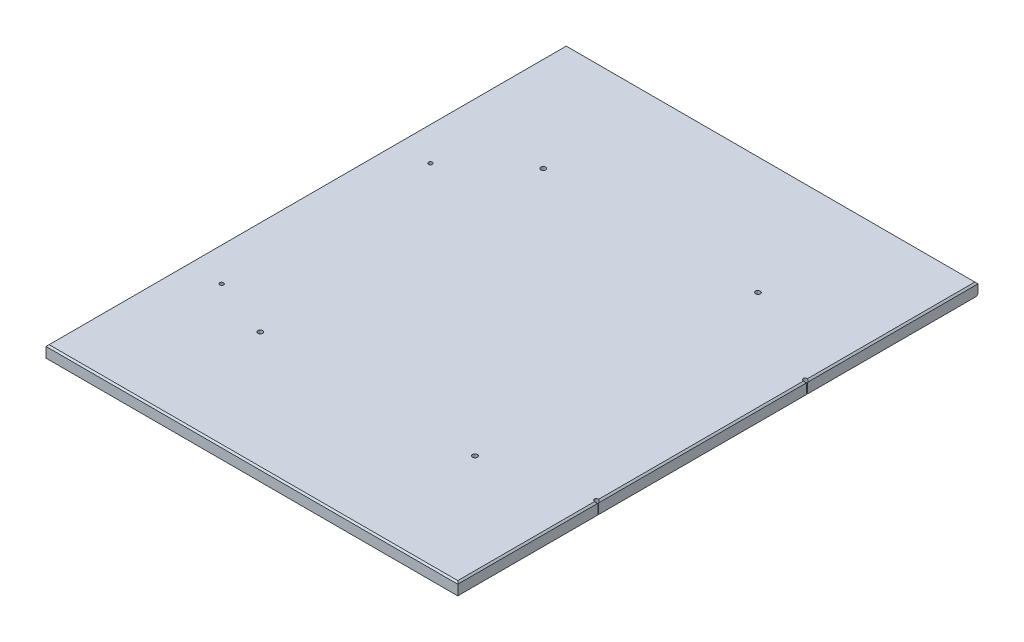
ISO-10303-21;
HEADER;
FILE_DESCRIPTION(('STEP AP214'),'2;1');
FILE_NAME('part.step','',(''),(''),'','','');
FILE_SCHEMA(('AUTOMOTIVE_DESIGN { 1 0 10303 214 1 1 1 1 }'));
ENDSEC;
DATA;
#1=APPLICATION_CONTEXT('core data for automotive mechanical design processes');
#2=APPLICATION_PROTOCOL_DEFINITION('international standard','automotive_design',2000,#1);
#3=PRODUCT_CONTEXT('',#1,'mechanical');
#4=PRODUCT('Part','Part','',(#3));
#5=PRODUCT_RELATED_PRODUCT_CATEGORY('part','',(#4));
#6=PRODUCT_DEFINITION_FORMATION('','',#4);
#7=PRODUCT_DEFINITION_CONTEXT('part definition',#1,'design');
#8=PRODUCT_DEFINITION('design','',#6,#7);
#9=PRODUCT_DEFINITION_SHAPE('','',#8);
#10=(LENGTH_UNIT() NAMED_UNIT(*) SI_UNIT(.MILLI.,.METRE.));
#11=(NAMED_UNIT(*) PLANE_ANGLE_UNIT() SI_UNIT($,.RADIAN.));
#12=(NAMED_UNIT(*) SI_UNIT($,.STERADIAN.) SOLID_ANGLE_UNIT());
#13=UNCERTAINTY_MEASURE_WITH_UNIT(LENGTH_MEASURE(1.E-05),#10,'distance_accuracy_value','');
#14=(GEOMETRIC_REPRESENTATION_CONTEXT(3) GLOBAL_UNCERTAINTY_ASSIGNED_CONTEXT((#13)) GLOBAL_UNIT_ASSIGNED_CONTEXT((#10,
#11,#12)) REPRESENTATION_CONTEXT('',''));
#15=CARTESIAN_POINT('',(0.,0.,0.));
#16=DIRECTION('',(0.,0.,1.));
#17=DIRECTION('',(1.,0.,0.));
#18=AXIS2_PLACEMENT_3D('',#15,#16,#17);
#19=CARTESIAN_POINT('',(669.8488,19.05,0.));
#20=DIRECTION('',(-1.,0.,0.));
#21=DIRECTION('',(0.,0.,1.));
#22=AXIS2_PLACEMENT_3D('',#19,#20,#21);
#23=PLANE('',#22);
#24=DIRECTION('',(0.,0.,-1.));
#25=VECTOR('',#24,1.);
#26=CARTESIAN_POINT('',(669.8488,0.,0.));
#27=LINE('',#26,#25);
#28=CARTESIAN_POINT('',(669.8488,0.,-229.291421405512));
#29=VERTEX_POINT('',#28);
#30=CARTESIAN_POINT('',(669.8488,0.,-567.633578594489));
#31=VERTEX_POINT('',#30);
#32=EDGE_CURVE('E186',#29,#31,#27,.T.);
#33=ORIENTED_EDGE('',*,*,#32,.T.);
#34=DIRECTION('',(0.,1.,0.));
#35=VECTOR('',#34,1.);
#36=CARTESIAN_POINT('',(669.8488,0.,-567.633578594489));
#37=LINE('',#36,#35);
#38=CARTESIAN_POINT('',(669.8488,16.5100000000001,-567.633578594489));
#39=VERTEX_POINT('',#38);
#40=EDGE_CURVE('E206',#31,#39,#37,.T.);
#41=ORIENTED_EDGE('',*,*,#40,.T.);
#42=DIRECTION('',(0.,0.,1.));
#43=VECTOR('',#42,1.);
#44=CARTESIAN_POINT('',(669.8488,16.5100000000001,0.));
#45=LINE('',#44,#43);
#46=CARTESIAN_POINT('',(669.8488,16.5100000000001,-229.291421405512));
#47=VERTEX_POINT('',#46);
#48=EDGE_CURVE('E289',#39,#47,#45,.T.);
#49=ORIENTED_EDGE('',*,*,#48,.T.);
#50=DIRECTION('',(0.,1.,0.));
#51=VECTOR('',#50,1.);
#52=CARTESIAN_POINT('',(669.8488,0.,-229.291421405512));
#53=LINE('',#52,#51);
#54=EDGE_CURVE('E57',#47,#29,#53,.F.);
#55=ORIENTED_EDGE('',*,*,#54,.T.);
#56=EDGE_LOOP('',(#33,#41,#49,#55));
#57=FACE_BOUND('',#56,.T.);
#58=ADVANCED_FACE('F41',(#57),#23,.F.);
#59=CARTESIAN_POINT('',(669.8488,0.,0.));
#60=VERTEX_POINT('',#59);
#61=CARTESIAN_POINT('',(669.8488,0.,-227.908578594488));
#62=VERTEX_POINT('',#61);
#63=EDGE_CURVE('E183',#60,#62,#27,.T.);
#64=ORIENTED_EDGE('',*,*,#63,.T.);
#65=DIRECTION('',(0.,1.,0.));
#66=VECTOR('',#65,1.);
#67=CARTESIAN_POINT('',(669.8488,0.,-227.908578594488));
#68=LINE('',#67,#66);
#69=CARTESIAN_POINT('',(669.8488,16.5100000000001,-227.908578594488));
#70=VERTEX_POINT('',#69);
#71=EDGE_CURVE('E223',#62,#70,#68,.T.);
#72=ORIENTED_EDGE('',*,*,#71,.T.);
#73=CARTESIAN_POINT('',(669.8488,16.5100000000001,0.));
#74=VERTEX_POINT('',#73);
#75=EDGE_CURVE('E153',#70,#74,#45,.T.);
#76=ORIENTED_EDGE('',*,*,#75,.T.);
#77=DIRECTION('',(0.,-1.,0.));
#78=VECTOR('',#77,1.);
#79=CARTESIAN_POINT('',(669.8488,19.05,0.));
#80=LINE('',#79,#78);
#81=EDGE_CURVE('E175',#74,#60,#80,.T.);
#82=ORIENTED_EDGE('',*,*,#81,.T.);
#83=EDGE_LOOP('',(#64,#72,#76,#82));
#84=FACE_BOUND('',#83,.T.);
#85=ADVANCED_FACE('F251',(#84),#23,.F.);
#86=CARTESIAN_POINT('',(667.3088,19.05,0.));
#87=DIRECTION('',(-0.707106781186532,-0.707106781186563,0.));
#88=DIRECTION('',(0.,0.,-1.));
#89=AXIS2_PLACEMENT_3D('',#86,#87,#88);
#90=PLANE('',#89);
#91=CARTESIAN_POINT('',(666.75,19.6088000000002,-568.325));
#92=DIRECTION('',(-0.707106781186532,-0.707106781186563,0.));
#93=DIRECTION('',(-0.707106781186563,0.707106781186532,0.));
#94=AXIS2_PLACEMENT_3D('',#91,#92,#93);
#95=ELLIPSE('',#94,4.49012806053459,3.17500000000008);
#96=CARTESIAN_POINT('',(667.3088,19.05,-565.199561221204));
#97=VERTEX_POINT('',#96);
#98=EDGE_CURVE('E11',#97,#39,#95,.F.);
#99=ORIENTED_EDGE('',*,*,#98,.F.);
#100=DIRECTION('',(0.,0.,-1.));
#101=VECTOR('',#100,1.);
#102=CARTESIAN_POINT('',(667.3088,19.05,0.));
#103=LINE('',#102,#101);
#104=CARTESIAN_POINT('',(667.3088,19.05,-231.725438778796));
#105=VERTEX_POINT('',#104);
#106=EDGE_CURVE('E159',#105,#97,#103,.T.);
#107=ORIENTED_EDGE('',*,*,#106,.F.);
#108=CARTESIAN_POINT('',(666.75,19.6088000000001,-228.6));
#109=DIRECTION('',(-0.707106781186532,-0.707106781186563,0.));
#110=DIRECTION('',(-0.707106781186563,0.707106781186532,0.));
#111=AXIS2_PLACEMENT_3D('',#108,#109,#110);
#112=ELLIPSE('',#111,4.4901280605346,3.17500000000009);
#113=EDGE_CURVE('E139',#47,#105,#112,.F.);
#114=ORIENTED_EDGE('',*,*,#113,.F.);
#115=ORIENTED_EDGE('',*,*,#48,.F.);
#116=EDGE_LOOP('',(#99,#107,#114,#115));
#117=FACE_BOUND('',#116,.T.);
#118=ADVANCED_FACE('F300',(#117),#90,.F.);
#119=CARTESIAN_POINT('',(667.3088,19.05,-225.474561221204));
#120=VERTEX_POINT('',#119);
#121=EDGE_CURVE('E137',#120,#70,#112,.F.);
#122=ORIENTED_EDGE('',*,*,#121,.F.);
#123=CARTESIAN_POINT('',(667.3088,19.05,-2.53999999999999));
#124=VERTEX_POINT('',#123);
#125=EDGE_CURVE('E152',#124,#120,#103,.T.);
#126=ORIENTED_EDGE('',*,*,#125,.F.);
#127=DIRECTION('',(-0.577350269189634,0.577350269189609,-0.577350269189634));
#128=VECTOR('',#127,1.);
#129=CARTESIAN_POINT('',(444.872533333327,241.486266666664,-224.976266666673));
#130=LINE('',#129,#128);
#131=EDGE_CURVE('E193',#124,#74,#130,.F.);
#132=ORIENTED_EDGE('',*,*,#131,.T.);
#133=ORIENTED_EDGE('',*,*,#75,.F.);
#134=EDGE_LOOP('',(#122,#126,#132,#133));
#135=FACE_BOUND('',#134,.T.);
#136=ADVANCED_FACE('F150',(#135),#90,.F.);
#137=CARTESIAN_POINT('',(0.,19.05,0.));
#138=DIRECTION('',(1.,0.,0.));
#139=DIRECTION('',(0.,0.,-1.));
#140=AXIS2_PLACEMENT_3D('',#137,#138,#139);
#141=PLANE('',#140);
#142=DIRECTION('',(0.,-1.,0.));
#143=VECTOR('',#142,1.);
#144=CARTESIAN_POINT('',(0.,19.05,-846.328));
#145=LINE('',#144,#143);
#146=CARTESIAN_POINT('',(0.,16.5100000000001,-846.328));
#147=VERTEX_POINT('',#146);
#148=CARTESIAN_POINT('',(0.,2.5400000000001,-846.328));
#149=VERTEX_POINT('',#148);
#150=EDGE_CURVE('E180',#147,#149,#145,.T.);
#151=ORIENTED_EDGE('',*,*,#150,.T.);
#152=DIRECTION('',(0.,-0.707106781186548,0.707106781186548));
#153=VECTOR('',#152,1.);
#154=CARTESIAN_POINT('',(0.,2.5400000000001,-846.328));
#155=LINE('',#154,#153);
#156=CARTESIAN_POINT('',(0.,0.,-843.788));
#157=VERTEX_POINT('',#156);
#158=EDGE_CURVE('E266',#149,#157,#155,.T.);
#159=ORIENTED_EDGE('',*,*,#158,.T.);
#160=DIRECTION('',(0.,0.,1.));
#161=VECTOR('',#160,1.);
#162=CARTESIAN_POINT('',(0.,0.,0.));
#163=LINE('',#162,#161);
#164=CARTESIAN_POINT('',(0.,0.,0.));
#165=VERTEX_POINT('',#164);
#166=EDGE_CURVE('E191',#157,#165,#163,.T.);
#167=ORIENTED_EDGE('',*,*,#166,.T.);
#168=DIRECTION('',(0.,-1.,0.));
#169=VECTOR('',#168,1.);
#170=CARTESIAN_POINT('',(0.,19.05,0.));
#171=LINE('',#170,#169);
#172=CARTESIAN_POINT('',(0.,16.5100000000001,0.));
#173=VERTEX_POINT('',#172);
#174=EDGE_CURVE('E170',#173,#165,#171,.T.);
#175=ORIENTED_EDGE('',*,*,#174,.F.);
#176=DIRECTION('',(0.,0.,-1.));
#177=VECTOR('',#176,1.);
#178=CARTESIAN_POINT('',(0.,16.5100000000001,0.));
#179=LINE('',#178,#177);
#180=EDGE_CURVE('E275',#173,#147,#179,.T.);
#181=ORIENTED_EDGE('',*,*,#180,.T.);
#182=EDGE_LOOP('',(#151,#159,#167,#175,#181));
#183=FACE_BOUND('',#182,.T.);
#184=ADVANCED_FACE('F315',(#183),#141,.F.);
#185=CARTESIAN_POINT('',(0.,19.05,0.));
#186=DIRECTION('',(0.,0.,-1.));
#187=DIRECTION('',(-1.,0.,0.));
#188=AXIS2_PLACEMENT_3D('',#185,#186,#187);
#189=PLANE('',#188);
#190=ORIENTED_EDGE('',*,*,#81,.F.);
#191=DIRECTION('',(-1.,0.,0.));
#192=VECTOR('',#191,1.);
#193=CARTESIAN_POINT('',(0.,16.5100000000001,0.));
#194=LINE('',#193,#192);
#195=EDGE_CURVE('E284',#74,#173,#194,.T.);
#196=ORIENTED_EDGE('',*,*,#195,.T.);
#197=ORIENTED_EDGE('',*,*,#174,.T.);
#198=DIRECTION('',(1.,0.,0.));
#199=VECTOR('',#198,1.);
#200=CARTESIAN_POINT('',(0.,0.,0.));
#201=LINE('',#200,#199);
#202=EDGE_CURVE('E188',#165,#60,#201,.T.);
#203=ORIENTED_EDGE('',*,*,#202,.T.);
#204=EDGE_LOOP('',(#190,#196,#197,#203));
#205=FACE_BOUND('',#204,.T.);
#206=ADVANCED_FACE('F255',(#205),#189,.F.);
#207=CARTESIAN_POINT('',(669.8488,16.5100000000001,-846.328));
#208=VERTEX_POINT('',#207);
#209=CARTESIAN_POINT('',(669.8488,16.5100000000001,-569.016421405511));
#210=VERTEX_POINT('',#209);
#211=EDGE_CURVE('E286',#208,#210,#45,.T.);
#212=ORIENTED_EDGE('',*,*,#211,.T.);
#213=DIRECTION('',(0.,1.,0.));
#214=VECTOR('',#213,1.);
#215=CARTESIAN_POINT('',(669.8488,0.,-569.016421405511));
#216=LINE('',#215,#214);
#217=CARTESIAN_POINT('',(669.8488,0.,-569.016421405511));
#218=VERTEX_POINT('',#217);
#219=EDGE_CURVE('E65',#210,#218,#216,.F.);
#220=ORIENTED_EDGE('',*,*,#219,.T.);
#221=CARTESIAN_POINT('',(669.8488,0.,-843.788));
#222=VERTEX_POINT('',#221);
#223=EDGE_CURVE('E187',#218,#222,#27,.T.);
#224=ORIENTED_EDGE('',*,*,#223,.T.);
#225=DIRECTION('',(0.,0.707106781186548,-0.707106781186548));
#226=VECTOR('',#225,1.);
#227=CARTESIAN_POINT('',(669.8488,2.5400000000001,-846.328));
#228=LINE('',#227,#226);
#229=CARTESIAN_POINT('',(669.8488,2.5400000000001,-846.328));
#230=VERTEX_POINT('',#229);
#231=EDGE_CURVE('E268',#222,#230,#228,.T.);
#232=ORIENTED_EDGE('',*,*,#231,.T.);
#233=DIRECTION('',(0.,-1.,0.));
#234=VECTOR('',#233,1.);
#235=CARTESIAN_POINT('',(669.8488,19.05,-846.328));
#236=LINE('',#235,#234);
#237=EDGE_CURVE('E177',#208,#230,#236,.T.);
#238=ORIENTED_EDGE('',*,*,#237,.F.);
#239=EDGE_LOOP('',(#212,#220,#224,#232,#238));
#240=FACE_BOUND('',#239,.T.);
#241=ADVANCED_FACE('F318',(#240),#23,.F.);
#242=CARTESIAN_POINT('',(0.,19.05,-846.328));
#243=DIRECTION('',(0.,0.,1.));
#244=DIRECTION('',(1.,0.,0.));
#245=AXIS2_PLACEMENT_3D('',#242,#243,#244);
#246=PLANE('',#245);
#247=ORIENTED_EDGE('',*,*,#237,.T.);
#248=DIRECTION('',(-1.,0.,0.));
#249=VECTOR('',#248,1.);
#250=CARTESIAN_POINT('',(0.,2.5400000000001,-846.328));
#251=LINE('',#250,#249);
#252=EDGE_CURVE('E271',#230,#149,#251,.T.);
#253=ORIENTED_EDGE('',*,*,#252,.T.);
#254=ORIENTED_EDGE('',*,*,#150,.F.);
#255=DIRECTION('',(1.,0.,0.));
#256=VECTOR('',#255,1.);
#257=CARTESIAN_POINT('',(0.,16.5100000000001,-846.328));
#258=LINE('',#257,#256);
#259=EDGE_CURVE('E163',#147,#208,#258,.T.);
#260=ORIENTED_EDGE('',*,*,#259,.T.);
#261=EDGE_LOOP('',(#247,#253,#254,#260));
#262=FACE_BOUND('',#261,.T.);
#263=ADVANCED_FACE('F316',(#262),#246,.F.);
#264=CARTESIAN_POINT('',(0.,19.05,0.));
#265=DIRECTION('',(0.,-1.,0.));
#266=DIRECTION('',(0.,0.,-1.));
#267=AXIS2_PLACEMENT_3D('',#264,#265,#266);
#268=PLANE('',#267);
#269=CARTESIAN_POINT('',(57.15,19.05,-228.6));
#270=DIRECTION('',(0.,1.,0.));
#271=DIRECTION('',(0.,0.,1.));
#272=AXIS2_PLACEMENT_3D('',#269,#270,#271);
#273=CIRCLE('',#272,3.175);
#274=CARTESIAN_POINT('',(57.15,19.05,-225.425));
#275=VERTEX_POINT('',#274);
#276=EDGE_CURVE('E230',#275,#275,#273,.T.);
#277=ORIENTED_EDGE('',*,*,#276,.F.);
#278=EDGE_LOOP('',(#277));
#279=FACE_BOUND('',#278,.T.);
#280=CARTESIAN_POINT('',(57.1499999999999,19.05,-568.325));
#281=DIRECTION('',(0.,1.,0.));
#282=DIRECTION('',(0.,0.,1.));
#283=AXIS2_PLACEMENT_3D('',#280,#281,#282);
#284=CIRCLE('',#283,3.175);
#285=CARTESIAN_POINT('',(57.1499999999999,19.05,-565.15));
#286=VERTEX_POINT('',#285);
#287=EDGE_CURVE('E227',#286,#286,#284,.T.);
#288=ORIENTED_EDGE('',*,*,#287,.F.);
#289=EDGE_LOOP('',(#288));
#290=FACE_BOUND('',#289,.T.);
#291=CARTESIAN_POINT('',(505.58065,19.05,-652.658509598713));
#292=DIRECTION('',(0.,1.,0.));
#293=DIRECTION('',(0.,0.,1.));
#294=AXIS2_PLACEMENT_3D('',#291,#292,#293);
#295=CIRCLE('',#294,3.96875000000009);
#296=CARTESIAN_POINT('',(505.58065,19.05,-648.689759598713));
#297=VERTEX_POINT('',#296);
#298=EDGE_CURVE('E205',#297,#297,#295,.T.);
#299=ORIENTED_EDGE('',*,*,#298,.F.);
#300=EDGE_LOOP('',(#299));
#301=FACE_BOUND('',#300,.T.);
#302=CARTESIAN_POINT('',(156.33065,19.05,-652.658509598714));
#303=DIRECTION('',(0.,1.,0.));
#304=DIRECTION('',(0.,0.,1.));
#305=AXIS2_PLACEMENT_3D('',#302,#303,#304);
#306=CIRCLE('',#305,3.96874999999996);
#307=CARTESIAN_POINT('',(156.33065,19.05,-648.689759598714));
#308=VERTEX_POINT('',#307);
#309=EDGE_CURVE('E212',#308,#308,#306,.T.);
#310=ORIENTED_EDGE('',*,*,#309,.F.);
#311=EDGE_LOOP('',(#310));
#312=FACE_BOUND('',#311,.T.);
#313=CARTESIAN_POINT('',(156.33065,19.05,-192.283509598713));
#314=DIRECTION('',(0.,1.,0.));
#315=DIRECTION('',(0.,0.,1.));
#316=AXIS2_PLACEMENT_3D('',#313,#314,#315);
#317=CIRCLE('',#316,3.96874999999999);
#318=CARTESIAN_POINT('',(156.33065,19.05,-188.314759598713));
#319=VERTEX_POINT('',#318);
#320=EDGE_CURVE('E198',#319,#319,#317,.T.);
#321=ORIENTED_EDGE('',*,*,#320,.F.);
#322=EDGE_LOOP('',(#321));
#323=FACE_BOUND('',#322,.T.);
#324=CARTESIAN_POINT('',(505.58065,19.05,-192.283509598713));
#325=DIRECTION('',(0.,1.,0.));
#326=DIRECTION('',(0.,0.,1.));
#327=AXIS2_PLACEMENT_3D('',#324,#325,#326);
#328=CIRCLE('',#327,3.9687500000001);
#329=CARTESIAN_POINT('',(505.58065,19.05,-188.314759598713));
#330=VERTEX_POINT('',#329);
#331=EDGE_CURVE('E194',#330,#330,#328,.T.);
#332=ORIENTED_EDGE('',*,*,#331,.F.);
#333=EDGE_LOOP('',(#332));
#334=FACE_BOUND('',#333,.T.);
#335=ORIENTED_EDGE('',*,*,#106,.T.);
#336=CARTESIAN_POINT('',(666.75,19.05,-568.325));
#337=DIRECTION('',(0.,1.,0.));
#338=DIRECTION('',(0.,0.,1.));
#339=AXIS2_PLACEMENT_3D('',#336,#337,#338);
#340=CIRCLE('',#339,3.17500000000008);
#341=CARTESIAN_POINT('',(667.3088,19.05,-571.450438778796));
#342=VERTEX_POINT('',#341);
#343=EDGE_CURVE('E235',#342,#97,#340,.T.);
#344=ORIENTED_EDGE('',*,*,#343,.F.);
#345=CARTESIAN_POINT('',(667.3088,19.05,-843.788));
#346=VERTEX_POINT('',#345);
#347=EDGE_CURVE('E161',#342,#346,#103,.T.);
#348=ORIENTED_EDGE('',*,*,#347,.T.);
#349=DIRECTION('',(-1.,0.,0.));
#350=VECTOR('',#349,1.);
#351=CARTESIAN_POINT('',(0.,19.05,-843.788));
#352=LINE('',#351,#350);
#353=CARTESIAN_POINT('',(2.53999999999999,19.05,-843.788));
#354=VERTEX_POINT('',#353);
#355=EDGE_CURVE('E158',#346,#354,#352,.T.);
#356=ORIENTED_EDGE('',*,*,#355,.T.);
#357=DIRECTION('',(0.,0.,1.));
#358=VECTOR('',#357,1.);
#359=CARTESIAN_POINT('',(2.53999999999999,19.05,0.));
#360=LINE('',#359,#358);
#361=CARTESIAN_POINT('',(2.53999999999999,19.05,-2.53999999999999));
#362=VERTEX_POINT('',#361);
#363=EDGE_CURVE('E169',#354,#362,#360,.T.);
#364=ORIENTED_EDGE('',*,*,#363,.T.);
#365=DIRECTION('',(1.,0.,0.));
#366=VECTOR('',#365,1.);
#367=CARTESIAN_POINT('',(0.,19.05,-2.53999999999999));
#368=LINE('',#367,#366);
#369=EDGE_CURVE('E156',#362,#124,#368,.T.);
#370=ORIENTED_EDGE('',*,*,#369,.T.);
#371=ORIENTED_EDGE('',*,*,#125,.T.);
#372=CARTESIAN_POINT('',(666.75,19.05,-228.6));
#373=DIRECTION('',(0.,1.,0.));
#374=DIRECTION('',(0.,0.,1.));
#375=AXIS2_PLACEMENT_3D('',#372,#373,#374);
#376=CIRCLE('',#375,3.17500000000009);
#377=EDGE_CURVE('E134',#105,#120,#376,.T.);
#378=ORIENTED_EDGE('',*,*,#377,.F.);
#379=EDGE_LOOP('',(#335,#344,#348,#356,#364,#370,#371,#378));
#380=FACE_BOUND('',#379,.T.);
#381=ADVANCED_FACE('F154',(#279,#290,#301,#312,#323,#334,#380),#268,.F.);
#382=CARTESIAN_POINT('',(0.,0.,0.));
#383=DIRECTION('',(0.,-1.,0.));
#384=DIRECTION('',(0.,0.,-1.));
#385=AXIS2_PLACEMENT_3D('',#382,#383,#384);
#386=PLANE('',#385);
#387=CARTESIAN_POINT('',(57.15,0.,-228.6));
#388=DIRECTION('',(0.,1.,0.));
#389=DIRECTION('',(0.,0.,1.));
#390=AXIS2_PLACEMENT_3D('',#387,#388,#389);
#391=CIRCLE('',#390,3.175);
#392=CARTESIAN_POINT('',(57.15,0.,-225.425));
#393=VERTEX_POINT('',#392);
#394=EDGE_CURVE('E237',#393,#393,#391,.T.);
#395=ORIENTED_EDGE('',*,*,#394,.T.);
#396=EDGE_LOOP('',(#395));
#397=FACE_BOUND('',#396,.T.);
#398=CARTESIAN_POINT('',(666.75,0.,-568.325));
#399=DIRECTION('',(0.,1.,0.));
#400=DIRECTION('',(0.,0.,1.));
#401=AXIS2_PLACEMENT_3D('',#398,#399,#400);
#402=CIRCLE('',#401,3.17500000000008);
#403=EDGE_CURVE('E144',#218,#31,#402,.T.);
#404=ORIENTED_EDGE('',*,*,#403,.T.);
#405=ORIENTED_EDGE('',*,*,#32,.F.);
#406=CARTESIAN_POINT('',(666.75,0.,-228.6));
#407=DIRECTION('',(0.,1.,0.));
#408=DIRECTION('',(0.,0.,1.));
#409=AXIS2_PLACEMENT_3D('',#406,#407,#408);
#410=CIRCLE('',#409,3.17500000000009);
#411=EDGE_CURVE('E145',#29,#62,#410,.T.);
#412=ORIENTED_EDGE('',*,*,#411,.T.);
#413=ORIENTED_EDGE('',*,*,#63,.F.);
#414=ORIENTED_EDGE('',*,*,#202,.F.);
#415=ORIENTED_EDGE('',*,*,#166,.F.);
#416=DIRECTION('',(1.,0.,0.));
#417=VECTOR('',#416,1.);
#418=CARTESIAN_POINT('',(669.8488,0.,-843.788));
#419=LINE('',#418,#417);
#420=EDGE_CURVE('E261',#157,#222,#419,.T.);
#421=ORIENTED_EDGE('',*,*,#420,.T.);
#422=ORIENTED_EDGE('',*,*,#223,.F.);
#423=EDGE_LOOP('',(#404,#405,#412,#413,#414,#415,#421,#422));
#424=FACE_BOUND('',#423,.T.);
#425=CARTESIAN_POINT('',(57.1499999999999,0.,-568.325));
#426=DIRECTION('',(0.,1.,0.));
#427=DIRECTION('',(0.,0.,1.));
#428=AXIS2_PLACEMENT_3D('',#425,#426,#427);
#429=CIRCLE('',#428,3.175);
#430=CARTESIAN_POINT('',(57.1499999999999,0.,-565.15));
#431=VERTEX_POINT('',#430);
#432=EDGE_CURVE('E226',#431,#431,#429,.T.);
#433=ORIENTED_EDGE('',*,*,#432,.T.);
#434=EDGE_LOOP('',(#433));
#435=FACE_BOUND('',#434,.T.);
#436=CARTESIAN_POINT('',(505.58065,0.,-652.658509598713));
#437=DIRECTION('',(0.,1.,0.));
#438=DIRECTION('',(0.,0.,1.));
#439=AXIS2_PLACEMENT_3D('',#436,#437,#438);
#440=CIRCLE('',#439,3.96875000000009);
#441=CARTESIAN_POINT('',(505.58065,0.,-648.689759598713));
#442=VERTEX_POINT('',#441);
#443=EDGE_CURVE('E202',#442,#442,#440,.T.);
#444=ORIENTED_EDGE('',*,*,#443,.T.);
#445=EDGE_LOOP('',(#444));
#446=FACE_BOUND('',#445,.T.);
#447=CARTESIAN_POINT('',(156.33065,0.,-652.658509598714));
#448=DIRECTION('',(0.,1.,0.));
#449=DIRECTION('',(0.,0.,1.));
#450=AXIS2_PLACEMENT_3D('',#447,#448,#449);
#451=CIRCLE('',#450,3.96874999999996);
#452=CARTESIAN_POINT('',(156.33065,0.,-648.689759598714));
#453=VERTEX_POINT('',#452);
#454=EDGE_CURVE('E209',#453,#453,#451,.T.);
#455=ORIENTED_EDGE('',*,*,#454,.T.);
#456=EDGE_LOOP('',(#455));
#457=FACE_BOUND('',#456,.T.);
#458=CARTESIAN_POINT('',(156.33065,0.,-192.283509598713));
#459=DIRECTION('',(0.,1.,0.));
#460=DIRECTION('',(0.,0.,1.));
#461=AXIS2_PLACEMENT_3D('',#458,#459,#460);
#462=CIRCLE('',#461,3.96874999999999);
#463=CARTESIAN_POINT('',(156.33065,0.,-188.314759598713));
#464=VERTEX_POINT('',#463);
#465=EDGE_CURVE('E215',#464,#464,#462,.T.);
#466=ORIENTED_EDGE('',*,*,#465,.T.);
#467=EDGE_LOOP('',(#466));
#468=FACE_BOUND('',#467,.T.);
#469=CARTESIAN_POINT('',(505.58065,0.,-192.283509598713));
#470=DIRECTION('',(0.,1.,0.));
#471=DIRECTION('',(0.,0.,1.));
#472=AXIS2_PLACEMENT_3D('',#469,#470,#471);
#473=CIRCLE('',#472,3.9687500000001);
#474=CARTESIAN_POINT('',(505.58065,0.,-188.314759598713));
#475=VERTEX_POINT('',#474);
#476=EDGE_CURVE('E197',#475,#475,#473,.T.);
#477=ORIENTED_EDGE('',*,*,#476,.T.);
#478=EDGE_LOOP('',(#477));
#479=FACE_BOUND('',#478,.T.);
#480=ADVANCED_FACE('F246',(#397,#424,#435,#446,#457,#468,#479),#386,.T.);
#481=CARTESIAN_POINT('',(0.,19.05,-2.53999999999999));
#482=DIRECTION('',(0.,-0.707106781186563,-0.707106781186532));
#483=DIRECTION('',(1.,0.,0.));
#484=AXIS2_PLACEMENT_3D('',#481,#482,#483);
#485=PLANE('',#484);
#486=DIRECTION('',(0.577350269189634,0.577350269189609,-0.577350269189634));
#487=VECTOR('',#486,1.);
#488=CARTESIAN_POINT('',(1.6933333333333,18.2033333333334,-1.6933333333333));
#489=LINE('',#488,#487);
#490=EDGE_CURVE('E277',#173,#362,#489,.T.);
#491=ORIENTED_EDGE('',*,*,#490,.F.);
#492=ORIENTED_EDGE('',*,*,#195,.F.);
#493=ORIENTED_EDGE('',*,*,#131,.F.);
#494=ORIENTED_EDGE('',*,*,#369,.F.);
#495=EDGE_LOOP('',(#491,#492,#493,#494));
#496=FACE_BOUND('',#495,.T.);
#497=ADVANCED_FACE('F312',(#496),#485,.F.);
#498=EDGE_CURVE('E46',#210,#342,#95,.F.);
#499=ORIENTED_EDGE('',*,*,#498,.F.);
#500=ORIENTED_EDGE('',*,*,#211,.F.);
#501=DIRECTION('',(-0.577350269189634,0.577350269189609,0.577350269189634));
#502=VECTOR('',#501,1.);
#503=CARTESIAN_POINT('',(386.046133333325,300.312666666663,-562.525333333325));
#504=LINE('',#503,#502);
#505=EDGE_CURVE('E280',#346,#208,#504,.F.);
#506=ORIENTED_EDGE('',*,*,#505,.F.);
#507=ORIENTED_EDGE('',*,*,#347,.F.);
#508=EDGE_LOOP('',(#499,#500,#506,#507));
#509=FACE_BOUND('',#508,.T.);
#510=ADVANCED_FACE('F302',(#509),#90,.F.);
#511=CARTESIAN_POINT('',(2.53999999999999,19.05,0.));
#512=DIRECTION('',(0.707106781186532,-0.707106781186563,0.));
#513=DIRECTION('',(0.,0.,1.));
#514=AXIS2_PLACEMENT_3D('',#511,#512,#513);
#515=PLANE('',#514);
#516=ORIENTED_EDGE('',*,*,#490,.T.);
#517=ORIENTED_EDGE('',*,*,#363,.F.);
#518=DIRECTION('',(-0.577350269189634,-0.577350269189609,-0.577350269189634));
#519=VECTOR('',#518,1.);
#520=CARTESIAN_POINT('',(283.802666666675,300.312666666663,-562.525333333325));
#521=LINE('',#520,#519);
#522=EDGE_CURVE('E201',#147,#354,#521,.F.);
#523=ORIENTED_EDGE('',*,*,#522,.F.);
#524=ORIENTED_EDGE('',*,*,#180,.F.);
#525=EDGE_LOOP('',(#516,#517,#523,#524));
#526=FACE_BOUND('',#525,.T.);
#527=ADVANCED_FACE('F314',(#526),#515,.F.);
#528=CARTESIAN_POINT('',(0.,19.05,-843.788));
#529=DIRECTION('',(0.,-0.707106781186563,0.707106781186532));
#530=DIRECTION('',(-1.,0.,0.));
#531=AXIS2_PLACEMENT_3D('',#528,#529,#530);
#532=PLANE('',#531);
#533=ORIENTED_EDGE('',*,*,#505,.T.);
#534=ORIENTED_EDGE('',*,*,#259,.F.);
#535=ORIENTED_EDGE('',*,*,#522,.T.);
#536=ORIENTED_EDGE('',*,*,#355,.F.);
#537=EDGE_LOOP('',(#533,#534,#535,#536));
#538=FACE_BOUND('',#537,.T.);
#539=ADVANCED_FACE('F306',(#538),#532,.F.);
#540=CARTESIAN_POINT('',(0.,2.5400000000001,-846.328));
#541=DIRECTION('',(0.,-0.707106781186548,-0.707106781186548));
#542=DIRECTION('',(1.,0.,0.));
#543=AXIS2_PLACEMENT_3D('',#540,#541,#542);
#544=PLANE('',#543);
#545=ORIENTED_EDGE('',*,*,#231,.F.);
#546=ORIENTED_EDGE('',*,*,#420,.F.);
#547=ORIENTED_EDGE('',*,*,#158,.F.);
#548=ORIENTED_EDGE('',*,*,#252,.F.);
#549=EDGE_LOOP('',(#545,#546,#547,#548));
#550=FACE_BOUND('',#549,.T.);
#551=ADVANCED_FACE('F44',(#550),#544,.T.);
#552=CARTESIAN_POINT('',(505.58065,0.,-192.283509598713));
#553=DIRECTION('',(0.,1.,0.));
#554=DIRECTION('',(0.,0.,1.));
#555=AXIS2_PLACEMENT_3D('',#552,#553,#554);
#556=CYLINDRICAL_SURFACE('',#555,3.9687500000001);
#557=ORIENTED_EDGE('',*,*,#476,.F.);
#558=EDGE_LOOP('',(#557));
#559=FACE_BOUND('',#558,.T.);
#560=ORIENTED_EDGE('',*,*,#331,.T.);
#561=EDGE_LOOP('',(#560));
#562=FACE_BOUND('',#561,.T.);
#563=ADVANCED_FACE('F381',(#559,#562),#556,.F.);
#564=CARTESIAN_POINT('',(156.33065,0.,-192.283509598713));
#565=DIRECTION('',(0.,1.,0.));
#566=DIRECTION('',(0.,0.,1.));
#567=AXIS2_PLACEMENT_3D('',#564,#565,#566);
#568=CYLINDRICAL_SURFACE('',#567,3.96874999999999);
#569=ORIENTED_EDGE('',*,*,#465,.F.);
#570=EDGE_LOOP('',(#569));
#571=FACE_BOUND('',#570,.T.);
#572=ORIENTED_EDGE('',*,*,#320,.T.);
#573=EDGE_LOOP('',(#572));
#574=FACE_BOUND('',#573,.T.);
#575=ADVANCED_FACE('F384',(#571,#574),#568,.F.);
#576=CARTESIAN_POINT('',(156.33065,0.,-652.658509598714));
#577=DIRECTION('',(0.,1.,0.));
#578=DIRECTION('',(0.,0.,1.));
#579=AXIS2_PLACEMENT_3D('',#576,#577,#578);
#580=CYLINDRICAL_SURFACE('',#579,3.96874999999996);
#581=ORIENTED_EDGE('',*,*,#454,.F.);
#582=EDGE_LOOP('',(#581));
#583=FACE_BOUND('',#582,.T.);
#584=ORIENTED_EDGE('',*,*,#309,.T.);
#585=EDGE_LOOP('',(#584));
#586=FACE_BOUND('',#585,.T.);
#587=ADVANCED_FACE('F387',(#583,#586),#580,.F.);
#588=CARTESIAN_POINT('',(505.58065,0.,-652.658509598713));
#589=DIRECTION('',(0.,1.,0.));
#590=DIRECTION('',(0.,0.,1.));
#591=AXIS2_PLACEMENT_3D('',#588,#589,#590);
#592=CYLINDRICAL_SURFACE('',#591,3.96875000000009);
#593=ORIENTED_EDGE('',*,*,#443,.F.);
#594=EDGE_LOOP('',(#593));
#595=FACE_BOUND('',#594,.T.);
#596=ORIENTED_EDGE('',*,*,#298,.T.);
#597=EDGE_LOOP('',(#596));
#598=FACE_BOUND('',#597,.T.);
#599=ADVANCED_FACE('F330',(#595,#598),#592,.F.);
#600=CARTESIAN_POINT('',(666.75,0.,-228.6));
#601=DIRECTION('',(0.,1.,0.));
#602=DIRECTION('',(0.,0.,1.));
#603=AXIS2_PLACEMENT_3D('',#600,#601,#602);
#604=CYLINDRICAL_SURFACE('',#603,3.17500000000009);
#605=ORIENTED_EDGE('',*,*,#411,.F.);
#606=ORIENTED_EDGE('',*,*,#54,.F.);
#607=ORIENTED_EDGE('',*,*,#113,.T.);
#608=ORIENTED_EDGE('',*,*,#377,.T.);
#609=ORIENTED_EDGE('',*,*,#121,.T.);
#610=ORIENTED_EDGE('',*,*,#71,.F.);
#611=EDGE_LOOP('',(#605,#606,#607,#608,#609,#610));
#612=FACE_BOUND('',#611,.T.);
#613=ADVANCED_FACE('F136',(#612),#604,.F.);
#614=CARTESIAN_POINT('',(666.75,0.,-568.325));
#615=DIRECTION('',(0.,1.,0.));
#616=DIRECTION('',(0.,0.,1.));
#617=AXIS2_PLACEMENT_3D('',#614,#615,#616);
#618=CYLINDRICAL_SURFACE('',#617,3.17500000000008);
#619=ORIENTED_EDGE('',*,*,#403,.F.);
#620=ORIENTED_EDGE('',*,*,#219,.F.);
#621=ORIENTED_EDGE('',*,*,#498,.T.);
#622=ORIENTED_EDGE('',*,*,#343,.T.);
#623=ORIENTED_EDGE('',*,*,#98,.T.);
#624=ORIENTED_EDGE('',*,*,#40,.F.);
#625=EDGE_LOOP('',(#619,#620,#621,#622,#623,#624));
#626=FACE_BOUND('',#625,.T.);
#627=ADVANCED_FACE('F319',(#626),#618,.F.);
#628=CARTESIAN_POINT('',(57.1499999999999,0.,-568.325));
#629=DIRECTION('',(0.,1.,0.));
#630=DIRECTION('',(0.,0.,1.));
#631=AXIS2_PLACEMENT_3D('',#628,#629,#630);
#632=CYLINDRICAL_SURFACE('',#631,3.175);
#633=ORIENTED_EDGE('',*,*,#432,.F.);
#634=EDGE_LOOP('',(#633));
#635=FACE_BOUND('',#634,.T.);
#636=ORIENTED_EDGE('',*,*,#287,.T.);
#637=EDGE_LOOP('',(#636));
#638=FACE_BOUND('',#637,.T.);
#639=ADVANCED_FACE('F321',(#635,#638),#632,.F.);
#640=CARTESIAN_POINT('',(57.15,0.,-228.6));
#641=DIRECTION('',(0.,1.,0.));
#642=DIRECTION('',(0.,0.,1.));
#643=AXIS2_PLACEMENT_3D('',#640,#641,#642);
#644=CYLINDRICAL_SURFACE('',#643,3.175);
#645=ORIENTED_EDGE('',*,*,#394,.F.);
#646=EDGE_LOOP('',(#645));
#647=FACE_BOUND('',#646,.T.);
#648=ORIENTED_EDGE('',*,*,#276,.T.);
#649=EDGE_LOOP('',(#648));
#650=FACE_BOUND('',#649,.T.);
#651=ADVANCED_FACE('F327',(#647,#650),#644,.F.);
#652=CLOSED_SHELL('',(#58,#85,#118,#136,#184,#206,#241,#263,#381,#480,#497,#510,#527,#539,#551,
#563,#575,#587,#599,#613,#627,#639,#651));
#653=MANIFOLD_SOLID_BREP('B2',#652);
#654=ADVANCED_BREP_SHAPE_REPRESENTATION('',(#18,#653),#14);
#655=SHAPE_DEFINITION_REPRESENTATION(#9,#654);
ENDSEC;
END-ISO-10303-21;
